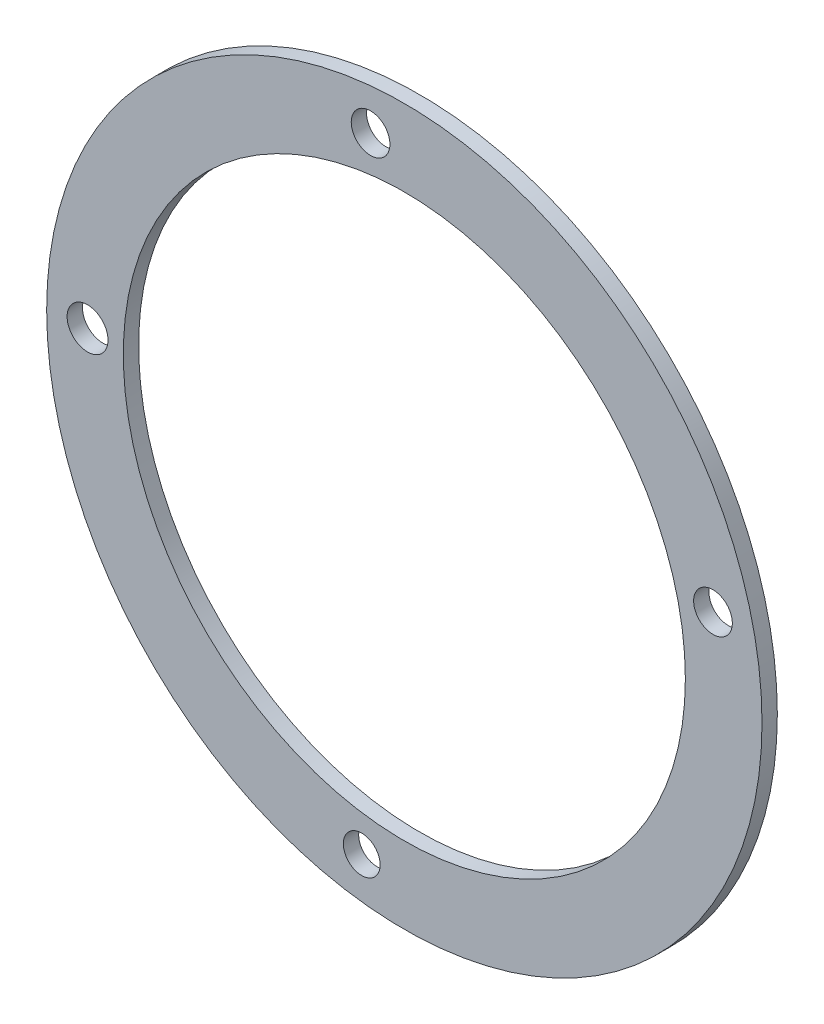
ISO-10303-21;
HEADER;
FILE_DESCRIPTION(('STEP AP214'),'2;1');
FILE_NAME('part.step','',(''),(''),'','','');
FILE_SCHEMA(('AUTOMOTIVE_DESIGN { 1 0 10303 214 1 1 1 1 }'));
ENDSEC;
DATA;
#1=APPLICATION_CONTEXT('core data for automotive mechanical design processes');
#2=APPLICATION_PROTOCOL_DEFINITION('international standard','automotive_design',2000,#1);
#3=PRODUCT_CONTEXT('',#1,'mechanical');
#4=PRODUCT('Part','Part','',(#3));
#5=PRODUCT_RELATED_PRODUCT_CATEGORY('part','',(#4));
#6=PRODUCT_DEFINITION_FORMATION('','',#4);
#7=PRODUCT_DEFINITION_CONTEXT('part definition',#1,'design');
#8=PRODUCT_DEFINITION('design','',#6,#7);
#9=PRODUCT_DEFINITION_SHAPE('','',#8);
#10=(LENGTH_UNIT() NAMED_UNIT(*) SI_UNIT(.MILLI.,.METRE.));
#11=(NAMED_UNIT(*) PLANE_ANGLE_UNIT() SI_UNIT($,.RADIAN.));
#12=(NAMED_UNIT(*) SI_UNIT($,.STERADIAN.) SOLID_ANGLE_UNIT());
#13=UNCERTAINTY_MEASURE_WITH_UNIT(LENGTH_MEASURE(1.E-05),#10,'distance_accuracy_value','');
#14=(GEOMETRIC_REPRESENTATION_CONTEXT(3) GLOBAL_UNCERTAINTY_ASSIGNED_CONTEXT((#13)) GLOBAL_UNIT_ASSIGNED_CONTEXT((#10,
#11,#12)) REPRESENTATION_CONTEXT('',''));
#15=CARTESIAN_POINT('',(0.,0.,0.));
#16=DIRECTION('',(0.,0.,1.));
#17=DIRECTION('',(1.,0.,0.));
#18=AXIS2_PLACEMENT_3D('',#15,#16,#17);
#19=CARTESIAN_POINT('',(0.,0.,3.));
#20=DIRECTION('',(0.,0.,1.));
#21=DIRECTION('',(1.,0.,0.));
#22=AXIS2_PLACEMENT_3D('',#19,#20,#21);
#23=PLANE('',#22);
#24=CARTESIAN_POINT('',(-8.33828127867153,-61.4367403539424,3.));
#25=DIRECTION('',(0.,0.,-1.));
#26=DIRECTION('',(-1.,0.,0.));
#27=AXIS2_PLACEMENT_3D('',#24,#25,#26);
#28=CIRCLE('',#27,3.60000000000001);
#29=CARTESIAN_POINT('',(-11.9382812786715,-61.4367403539424,3.));
#30=VERTEX_POINT('',#29);
#31=EDGE_CURVE('E64',#30,#30,#28,.T.);
#32=ORIENTED_EDGE('',*,*,#31,.T.);
#33=EDGE_LOOP('',(#32));
#34=FACE_BOUND('',#33,.T.);
#35=CARTESIAN_POINT('',(60.4011454195349,13.9893399418339,3.));
#36=DIRECTION('',(0.,0.,-1.));
#37=DIRECTION('',(-1.,0.,0.));
#38=AXIS2_PLACEMENT_3D('',#35,#36,#37);
#39=CIRCLE('',#38,3.78555809283008);
#40=CARTESIAN_POINT('',(56.6155873267048,13.9893399418339,3.));
#41=VERTEX_POINT('',#40);
#42=EDGE_CURVE('E58',#41,#41,#39,.T.);
#43=ORIENTED_EDGE('',*,*,#42,.T.);
#44=EDGE_LOOP('',(#43));
#45=FACE_BOUND('',#44,.T.);
#46=CARTESIAN_POINT('',(-6.60678835054308,61.6469816592113,3.));
#47=DIRECTION('',(0.,0.,-1.));
#48=DIRECTION('',(-1.,0.,0.));
#49=AXIS2_PLACEMENT_3D('',#46,#47,#48);
#50=CIRCLE('',#49,3.78555809283008);
#51=CARTESIAN_POINT('',(-10.3923464433732,61.6469816592113,3.));
#52=VERTEX_POINT('',#51);
#53=EDGE_CURVE('E52',#52,#52,#50,.T.);
#54=ORIENTED_EDGE('',*,*,#53,.T.);
#55=EDGE_LOOP('',(#54));
#56=FACE_BOUND('',#55,.T.);
#57=CARTESIAN_POINT('',(-61.9938660893829,0.872105092090499,3.));
#58=DIRECTION('',(0.,0.,-1.));
#59=DIRECTION('',(-1.,0.,0.));
#60=AXIS2_PLACEMENT_3D('',#57,#58,#59);
#61=CIRCLE('',#60,4.00000000000002);
#62=CARTESIAN_POINT('',(-65.9938660893829,0.872105092090499,3.));
#63=VERTEX_POINT('',#62);
#64=EDGE_CURVE('E46',#63,#63,#61,.T.);
#65=ORIENTED_EDGE('',*,*,#64,.T.);
#66=EDGE_LOOP('',(#65));
#67=FACE_BOUND('',#66,.T.);
#68=CARTESIAN_POINT('',(0.,0.,3.));
#69=DIRECTION('',(0.,0.,1.));
#70=DIRECTION('',(1.,0.,0.));
#71=AXIS2_PLACEMENT_3D('',#68,#69,#70);
#72=CIRCLE('',#71,70.);
#73=CARTESIAN_POINT('',(70.,0.,3.));
#74=VERTEX_POINT('',#73);
#75=EDGE_CURVE('E10',#74,#74,#72,.T.);
#76=ORIENTED_EDGE('',*,*,#75,.T.);
#77=EDGE_LOOP('',(#76));
#78=FACE_BOUND('',#77,.T.);
#79=CARTESIAN_POINT('',(0.,0.,3.));
#80=DIRECTION('',(0.,0.,1.));
#81=DIRECTION('',(1.,0.,0.));
#82=AXIS2_PLACEMENT_3D('',#79,#80,#81);
#83=CIRCLE('',#82,55.);
#84=CARTESIAN_POINT('',(55.,0.,3.));
#85=VERTEX_POINT('',#84);
#86=EDGE_CURVE('E41',#85,#85,#83,.T.);
#87=ORIENTED_EDGE('',*,*,#86,.F.);
#88=EDGE_LOOP('',(#87));
#89=FACE_BOUND('',#88,.T.);
#90=ADVANCED_FACE('F30',(#34,#45,#56,#67,#78,#89),#23,.T.);
#91=CARTESIAN_POINT('',(0.,0.,0.));
#92=DIRECTION('',(0.,0.,1.));
#93=DIRECTION('',(1.,0.,0.));
#94=AXIS2_PLACEMENT_3D('',#91,#92,#93);
#95=PLANE('',#94);
#96=CARTESIAN_POINT('',(-8.33828127867153,-61.4367403539424,0.));
#97=DIRECTION('',(0.,0.,-1.));
#98=DIRECTION('',(-1.,0.,0.));
#99=AXIS2_PLACEMENT_3D('',#96,#97,#98);
#100=CIRCLE('',#99,3.60000000000001);
#101=CARTESIAN_POINT('',(-11.9382812786715,-61.4367403539424,0.));
#102=VERTEX_POINT('',#101);
#103=EDGE_CURVE('E67',#102,#102,#100,.T.);
#104=ORIENTED_EDGE('',*,*,#103,.F.);
#105=EDGE_LOOP('',(#104));
#106=FACE_BOUND('',#105,.T.);
#107=CARTESIAN_POINT('',(60.4011454195349,13.9893399418339,0.));
#108=DIRECTION('',(0.,0.,-1.));
#109=DIRECTION('',(-1.,0.,0.));
#110=AXIS2_PLACEMENT_3D('',#107,#108,#109);
#111=CIRCLE('',#110,3.78555809283008);
#112=CARTESIAN_POINT('',(56.6155873267048,13.9893399418339,0.));
#113=VERTEX_POINT('',#112);
#114=EDGE_CURVE('E61',#113,#113,#111,.T.);
#115=ORIENTED_EDGE('',*,*,#114,.F.);
#116=EDGE_LOOP('',(#115));
#117=FACE_BOUND('',#116,.T.);
#118=CARTESIAN_POINT('',(-6.60678835054308,61.6469816592113,0.));
#119=DIRECTION('',(0.,0.,-1.));
#120=DIRECTION('',(-1.,0.,0.));
#121=AXIS2_PLACEMENT_3D('',#118,#119,#120);
#122=CIRCLE('',#121,3.78555809283008);
#123=CARTESIAN_POINT('',(-10.3923464433732,61.6469816592113,0.));
#124=VERTEX_POINT('',#123);
#125=EDGE_CURVE('E55',#124,#124,#122,.T.);
#126=ORIENTED_EDGE('',*,*,#125,.F.);
#127=EDGE_LOOP('',(#126));
#128=FACE_BOUND('',#127,.T.);
#129=CARTESIAN_POINT('',(-61.9938660893829,0.872105092090499,0.));
#130=DIRECTION('',(0.,0.,-1.));
#131=DIRECTION('',(-1.,0.,0.));
#132=AXIS2_PLACEMENT_3D('',#129,#130,#131);
#133=CIRCLE('',#132,4.00000000000002);
#134=CARTESIAN_POINT('',(-65.9938660893829,0.872105092090499,0.));
#135=VERTEX_POINT('',#134);
#136=EDGE_CURVE('E49',#135,#135,#133,.T.);
#137=ORIENTED_EDGE('',*,*,#136,.F.);
#138=EDGE_LOOP('',(#137));
#139=FACE_BOUND('',#138,.T.);
#140=CARTESIAN_POINT('',(0.,0.,0.));
#141=DIRECTION('',(0.,0.,1.));
#142=DIRECTION('',(1.,0.,0.));
#143=AXIS2_PLACEMENT_3D('',#140,#141,#142);
#144=CIRCLE('',#143,70.);
#145=CARTESIAN_POINT('',(70.,0.,0.));
#146=VERTEX_POINT('',#145);
#147=EDGE_CURVE('E34',#146,#146,#144,.T.);
#148=ORIENTED_EDGE('',*,*,#147,.F.);
#149=EDGE_LOOP('',(#148));
#150=FACE_BOUND('',#149,.T.);
#151=CARTESIAN_POINT('',(0.,0.,0.));
#152=DIRECTION('',(0.,0.,1.));
#153=DIRECTION('',(1.,0.,0.));
#154=AXIS2_PLACEMENT_3D('',#151,#152,#153);
#155=CIRCLE('',#154,55.);
#156=CARTESIAN_POINT('',(55.,0.,0.));
#157=VERTEX_POINT('',#156);
#158=EDGE_CURVE('E43',#157,#157,#155,.T.);
#159=ORIENTED_EDGE('',*,*,#158,.T.);
#160=EDGE_LOOP('',(#159));
#161=FACE_BOUND('',#160,.T.);
#162=ADVANCED_FACE('F82',(#106,#117,#128,#139,#150,#161),#95,.F.);
#163=CARTESIAN_POINT('',(0.,0.,3.));
#164=DIRECTION('',(0.,0.,-1.));
#165=DIRECTION('',(-1.,0.,0.));
#166=AXIS2_PLACEMENT_3D('',#163,#164,#165);
#167=CYLINDRICAL_SURFACE('',#166,70.);
#168=ORIENTED_EDGE('',*,*,#75,.F.);
#169=EDGE_LOOP('',(#168));
#170=FACE_BOUND('',#169,.T.);
#171=ORIENTED_EDGE('',*,*,#147,.T.);
#172=EDGE_LOOP('',(#171));
#173=FACE_BOUND('',#172,.T.);
#174=ADVANCED_FACE('F32',(#170,#173),#167,.T.);
#175=CARTESIAN_POINT('',(0.,0.,3.));
#176=DIRECTION('',(0.,0.,-1.));
#177=DIRECTION('',(-1.,0.,0.));
#178=AXIS2_PLACEMENT_3D('',#175,#176,#177);
#179=CYLINDRICAL_SURFACE('',#178,55.);
#180=ORIENTED_EDGE('',*,*,#86,.T.);
#181=EDGE_LOOP('',(#180));
#182=FACE_BOUND('',#181,.T.);
#183=ORIENTED_EDGE('',*,*,#158,.F.);
#184=EDGE_LOOP('',(#183));
#185=FACE_BOUND('',#184,.T.);
#186=ADVANCED_FACE('F95',(#182,#185),#179,.F.);
#187=CARTESIAN_POINT('',(-61.9938660893829,0.872105092090499,3.));
#188=DIRECTION('',(0.,0.,-1.));
#189=DIRECTION('',(-1.,0.,0.));
#190=AXIS2_PLACEMENT_3D('',#187,#188,#189);
#191=CYLINDRICAL_SURFACE('',#190,4.00000000000002);
#192=ORIENTED_EDGE('',*,*,#64,.F.);
#193=EDGE_LOOP('',(#192));
#194=FACE_BOUND('',#193,.T.);
#195=ORIENTED_EDGE('',*,*,#136,.T.);
#196=EDGE_LOOP('',(#195));
#197=FACE_BOUND('',#196,.T.);
#198=ADVANCED_FACE('F97',(#194,#197),#191,.F.);
#199=CARTESIAN_POINT('',(-6.60678835054308,61.6469816592113,3.));
#200=DIRECTION('',(0.,0.,-1.));
#201=DIRECTION('',(-1.,0.,0.));
#202=AXIS2_PLACEMENT_3D('',#199,#200,#201);
#203=CYLINDRICAL_SURFACE('',#202,3.78555809283008);
#204=ORIENTED_EDGE('',*,*,#53,.F.);
#205=EDGE_LOOP('',(#204));
#206=FACE_BOUND('',#205,.T.);
#207=ORIENTED_EDGE('',*,*,#125,.T.);
#208=EDGE_LOOP('',(#207));
#209=FACE_BOUND('',#208,.T.);
#210=ADVANCED_FACE('F104',(#206,#209),#203,.F.);
#211=CARTESIAN_POINT('',(60.4011454195349,13.9893399418339,3.));
#212=DIRECTION('',(0.,0.,-1.));
#213=DIRECTION('',(-1.,0.,0.));
#214=AXIS2_PLACEMENT_3D('',#211,#212,#213);
#215=CYLINDRICAL_SURFACE('',#214,3.78555809283008);
#216=ORIENTED_EDGE('',*,*,#42,.F.);
#217=EDGE_LOOP('',(#216));
#218=FACE_BOUND('',#217,.T.);
#219=ORIENTED_EDGE('',*,*,#114,.T.);
#220=EDGE_LOOP('',(#219));
#221=FACE_BOUND('',#220,.T.);
#222=ADVANCED_FACE('F78',(#218,#221),#215,.F.);
#223=CARTESIAN_POINT('',(-8.33828127867153,-61.4367403539424,3.));
#224=DIRECTION('',(0.,0.,-1.));
#225=DIRECTION('',(-1.,0.,0.));
#226=AXIS2_PLACEMENT_3D('',#223,#224,#225);
#227=CYLINDRICAL_SURFACE('',#226,3.60000000000001);
#228=ORIENTED_EDGE('',*,*,#31,.F.);
#229=EDGE_LOOP('',(#228));
#230=FACE_BOUND('',#229,.T.);
#231=ORIENTED_EDGE('',*,*,#103,.T.);
#232=EDGE_LOOP('',(#231));
#233=FACE_BOUND('',#232,.T.);
#234=ADVANCED_FACE('F75',(#230,#233),#227,.F.);
#235=CLOSED_SHELL('',(#90,#162,#174,#186,#198,#210,#222,#234));
#236=MANIFOLD_SOLID_BREP('B2',#235);
#237=ADVANCED_BREP_SHAPE_REPRESENTATION('',(#18,#236),#14);
#238=SHAPE_DEFINITION_REPRESENTATION(#9,#237);
ENDSEC;
END-ISO-10303-21;
